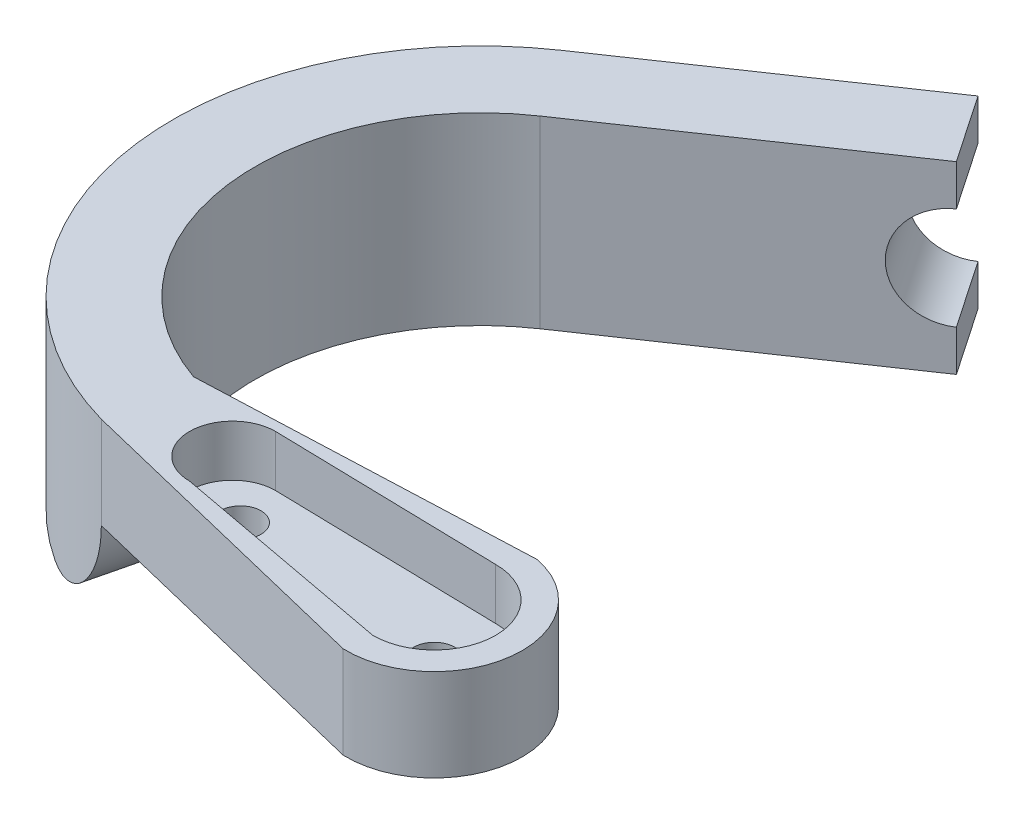
ISO-10303-21;
HEADER;
FILE_DESCRIPTION(('STEP AP214'),'2;1');
FILE_NAME('part.step','',(''),(''),'','','');
FILE_SCHEMA(('AUTOMOTIVE_DESIGN { 1 0 10303 214 1 1 1 1 }'));
ENDSEC;
DATA;
#1=APPLICATION_CONTEXT('core data for automotive mechanical design processes');
#2=APPLICATION_PROTOCOL_DEFINITION('international standard','automotive_design',2000,#1);
#3=PRODUCT_CONTEXT('',#1,'mechanical');
#4=PRODUCT('Part','Part','',(#3));
#5=PRODUCT_RELATED_PRODUCT_CATEGORY('part','',(#4));
#6=PRODUCT_DEFINITION_FORMATION('','',#4);
#7=PRODUCT_DEFINITION_CONTEXT('part definition',#1,'design');
#8=PRODUCT_DEFINITION('design','',#6,#7);
#9=PRODUCT_DEFINITION_SHAPE('','',#8);
#10=(LENGTH_UNIT() NAMED_UNIT(*) SI_UNIT(.MILLI.,.METRE.));
#11=(NAMED_UNIT(*) PLANE_ANGLE_UNIT() SI_UNIT($,.RADIAN.));
#12=(NAMED_UNIT(*) SI_UNIT($,.STERADIAN.) SOLID_ANGLE_UNIT());
#13=UNCERTAINTY_MEASURE_WITH_UNIT(LENGTH_MEASURE(1.E-05),#10,'distance_accuracy_value','');
#14=(GEOMETRIC_REPRESENTATION_CONTEXT(3) GLOBAL_UNCERTAINTY_ASSIGNED_CONTEXT((#13)) GLOBAL_UNIT_ASSIGNED_CONTEXT((#10,
#11,#12)) REPRESENTATION_CONTEXT('',''));
#15=CARTESIAN_POINT('',(0.,0.,0.));
#16=DIRECTION('',(0.,0.,1.));
#17=DIRECTION('',(1.,0.,0.));
#18=AXIS2_PLACEMENT_3D('',#15,#16,#17);
#19=CARTESIAN_POINT('',(0.,0.,0.));
#20=DIRECTION('',(0.,1.,0.));
#21=DIRECTION('',(0.,0.,1.));
#22=AXIS2_PLACEMENT_3D('',#19,#20,#21);
#23=PLANE('',#22);
#24=DIRECTION('',(-0.236788639930873,0.,0.971561186956173));
#25=VECTOR('',#24,1.);
#26=CARTESIAN_POINT('',(-6.07979117203185,0.,3.65452624166835));
#27=LINE('',#26,#25);
#28=CARTESIAN_POINT('',(-8.24336671734017,0.,12.5318356661524));
#29=VERTEX_POINT('',#28);
#30=CARTESIAN_POINT('',(-7.21355707621285,0.,8.30645104649894));
#31=VERTEX_POINT('',#30);
#32=EDGE_CURVE('E12',#29,#31,#27,.F.);
#33=ORIENTED_EDGE('',*,*,#32,.F.);
#34=CARTESIAN_POINT('',(0.,0.,0.));
#35=DIRECTION('',(0.,1.,0.));
#36=DIRECTION('',(0.,0.,1.));
#37=AXIS2_PLACEMENT_3D('',#34,#35,#36);
#38=CIRCLE('',#37,15.);
#39=CARTESIAN_POINT('',(-8.44052173184958,0.,-12.3999029389014));
#40=VERTEX_POINT('',#39);
#41=EDGE_CURVE('E170',#40,#29,#38,.T.);
#42=ORIENTED_EDGE('',*,*,#41,.F.);
#43=DIRECTION('',(0.826660195926758,0.,-0.562701448789972));
#44=VECTOR('',#43,1.);
#45=CARTESIAN_POINT('',(-8.44052173184958,0.,-12.3999029389014));
#46=LINE('',#45,#44);
#47=CARTESIAN_POINT('',(3.66314351152856,0.,-20.6387778740641));
#48=VERTEX_POINT('',#47);
#49=EDGE_CURVE('E236',#40,#48,#46,.T.);
#50=ORIENTED_EDGE('',*,*,#49,.T.);
#51=DIRECTION('',(0.562701448789973,0.,0.826660195926758));
#52=VECTOR('',#51,1.);
#53=CARTESIAN_POINT('',(12.1036652433781,0.,-8.23887493516278));
#54=LINE('',#53,#52);
#55=CARTESIAN_POINT('',(5.91311721210103,0.,-17.3333595138574));
#56=VERTEX_POINT('',#55);
#57=EDGE_CURVE('E234',#48,#56,#54,.T.);
#58=ORIENTED_EDGE('',*,*,#57,.T.);
#59=DIRECTION('',(0.826660195926758,0.,-0.562701448789973));
#60=VECTOR('',#59,1.);
#61=CARTESIAN_POINT('',(-6.19054803127711,0.,-9.09448457869466));
#62=LINE('',#61,#60);
#63=CARTESIAN_POINT('',(-6.19054803127711,0.,-9.09448457869466));
#64=VERTEX_POINT('',#63);
#65=EDGE_CURVE('E230',#64,#56,#62,.T.);
#66=ORIENTED_EDGE('',*,*,#65,.F.);
#67=CARTESIAN_POINT('',(0.,0.,0.));
#68=DIRECTION('',(0.,1.,0.));
#69=DIRECTION('',(0.,0.,1.));
#70=AXIS2_PLACEMENT_3D('',#67,#68,#69);
#71=CIRCLE('',#70,11.0014787496801);
#72=EDGE_CURVE('E227',#64,#31,#71,.T.);
#73=ORIENTED_EDGE('',*,*,#72,.T.);
#74=EDGE_LOOP('',(#33,#42,#50,#58,#66,#73));
#75=FACE_BOUND('',#74,.T.);
#76=ADVANCED_FACE('F38',(#75),#23,.F.);
#77=CARTESIAN_POINT('',(12.1036652433781,9.,-8.23887493516278));
#78=DIRECTION('',(0.826660195926758,0.,-0.562701448789973));
#79=DIRECTION('',(-0.562701448789973,0.,-0.826660195926758));
#80=AXIS2_PLACEMENT_3D('',#77,#78,#79);
#81=PLANE('',#80);
#82=DIRECTION('',(-0.562701448789972,0.,-0.826660195926758));
#83=VECTOR('',#82,1.);
#84=CARTESIAN_POINT('',(6.47665075547842,2.,-16.5054768944304));
#85=LINE('',#84,#83);
#86=CARTESIAN_POINT('',(5.91311721210103,2.,-17.3333595138574));
#87=VERTEX_POINT('',#86);
#88=CARTESIAN_POINT('',(3.66314351152856,2.,-20.6387778740641));
#89=VERTEX_POINT('',#88);
#90=EDGE_CURVE('E60',#87,#89,#85,.T.);
#91=ORIENTED_EDGE('',*,*,#90,.F.);
#92=DIRECTION('',(0.,-1.,0.));
#93=VECTOR('',#92,1.);
#94=CARTESIAN_POINT('',(5.91311721210103,9.,-17.3333595138574));
#95=LINE('',#94,#93);
#96=EDGE_CURVE('E189',#87,#56,#95,.T.);
#97=ORIENTED_EDGE('',*,*,#96,.T.);
#98=ORIENTED_EDGE('',*,*,#57,.F.);
#99=DIRECTION('',(0.,-1.,0.));
#100=VECTOR('',#99,1.);
#101=CARTESIAN_POINT('',(3.66314351152856,9.,-20.6387778740641));
#102=LINE('',#101,#100);
#103=EDGE_CURVE('E179',#89,#48,#102,.T.);
#104=ORIENTED_EDGE('',*,*,#103,.F.);
#105=EDGE_LOOP('',(#91,#97,#98,#104));
#106=FACE_BOUND('',#105,.T.);
#107=ADVANCED_FACE('F323',(#106),#81,.T.);
#108=CARTESIAN_POINT('',(11.696028788895,9.,13.95026889302));
#109=DIRECTION('',(0.,-1.,0.));
#110=DIRECTION('',(0.,0.,-1.));
#111=AXIS2_PLACEMENT_3D('',#108,#109,#110);
#112=CYLINDRICAL_SURFACE('',#111,1.);
#113=CARTESIAN_POINT('',(11.696028788895,4.5,13.95026889302));
#114=DIRECTION('',(0.,1.,0.));
#115=DIRECTION('',(0.,0.,1.));
#116=AXIS2_PLACEMENT_3D('',#113,#114,#115);
#117=CIRCLE('',#116,1.);
#118=CARTESIAN_POINT('',(11.696028788895,4.5,14.9502688930201));
#119=VERTEX_POINT('',#118);
#120=EDGE_CURVE('E214',#119,#119,#117,.T.);
#121=ORIENTED_EDGE('',*,*,#120,.F.);
#122=EDGE_LOOP('',(#121));
#123=FACE_BOUND('',#122,.T.);
#124=CARTESIAN_POINT('',(11.696028788895,6.5,13.95026889302));
#125=DIRECTION('',(0.,1.,0.));
#126=DIRECTION('',(0.,0.,1.));
#127=AXIS2_PLACEMENT_3D('',#124,#125,#126);
#128=CIRCLE('',#127,1.);
#129=CARTESIAN_POINT('',(11.696028788895,6.5,14.9502688930201));
#130=VERTEX_POINT('',#129);
#131=EDGE_CURVE('E265',#130,#130,#128,.F.);
#132=ORIENTED_EDGE('',*,*,#131,.F.);
#133=EDGE_LOOP('',(#132));
#134=FACE_BOUND('',#133,.T.);
#135=ADVANCED_FACE('F330',(#123,#134),#112,.F.);
#136=CARTESIAN_POINT('',(1.19602878889497,9.,12.9105347936986));
#137=DIRECTION('',(0.,-1.,0.));
#138=DIRECTION('',(0.,0.,-1.));
#139=AXIS2_PLACEMENT_3D('',#136,#137,#138);
#140=CYLINDRICAL_SURFACE('',#139,1.);
#141=CARTESIAN_POINT('',(1.19602878889497,4.5,12.9105347936986));
#142=DIRECTION('',(0.,1.,0.));
#143=DIRECTION('',(0.,0.,1.));
#144=AXIS2_PLACEMENT_3D('',#141,#142,#143);
#145=CIRCLE('',#144,1.);
#146=CARTESIAN_POINT('',(1.19602878889497,4.5,13.9105347936986));
#147=VERTEX_POINT('',#146);
#148=EDGE_CURVE('E510',#147,#147,#145,.T.);
#149=ORIENTED_EDGE('',*,*,#148,.F.);
#150=EDGE_LOOP('',(#149));
#151=FACE_BOUND('',#150,.T.);
#152=CARTESIAN_POINT('',(1.19602878889497,6.5,12.9105347936986));
#153=DIRECTION('',(0.,1.,0.));
#154=DIRECTION('',(0.,0.,1.));
#155=AXIS2_PLACEMENT_3D('',#152,#153,#154);
#156=CIRCLE('',#155,1.);
#157=CARTESIAN_POINT('',(1.19602878889497,6.5,13.9105347936986));
#158=VERTEX_POINT('',#157);
#159=EDGE_CURVE('E262',#158,#158,#156,.F.);
#160=ORIENTED_EDGE('',*,*,#159,.F.);
#161=EDGE_LOOP('',(#160));
#162=FACE_BOUND('',#161,.T.);
#163=ADVANCED_FACE('F40',(#151,#162),#140,.F.);
#164=CARTESIAN_POINT('',(-3.54951412236848,9.,14.5639172337523));
#165=DIRECTION('',(-0.236788639930873,0.,0.971561186956173));
#166=DIRECTION('',(0.971561186956173,0.,0.236788639930873));
#167=AXIS2_PLACEMENT_3D('',#164,#165,#166);
#168=PLANE('',#167);
#169=DIRECTION('',(-0.971561186956173,0.,-0.236788639930873));
#170=VECTOR('',#169,1.);
#171=CARTESIAN_POINT('',(-4.07565223003781,4.5,14.435686990919));
#172=LINE('',#171,#170);
#173=CARTESIAN_POINT('',(11.5407363085177,4.5,18.2417091461077));
#174=VERTEX_POINT('',#173);
#175=CARTESIAN_POINT('',(-4.07565223003781,4.5,14.435686990919));
#176=VERTEX_POINT('',#175);
#177=EDGE_CURVE('E153',#174,#176,#172,.T.);
#178=ORIENTED_EDGE('',*,*,#177,.F.);
#179=DIRECTION('',(0.,-1.,0.));
#180=VECTOR('',#179,1.);
#181=CARTESIAN_POINT('',(11.5407363085178,9.,18.2417091461077));
#182=LINE('',#181,#180);
#183=CARTESIAN_POINT('',(11.5407363085178,9.,18.2417091461077));
#184=VERTEX_POINT('',#183);
#185=EDGE_CURVE('E201',#184,#174,#182,.T.);
#186=ORIENTED_EDGE('',*,*,#185,.F.);
#187=DIRECTION('',(-0.971561186956173,0.,-0.236788639930873));
#188=VECTOR('',#187,1.);
#189=CARTESIAN_POINT('',(-3.54951412236848,9.,14.5639172337523));
#190=LINE('',#189,#188);
#191=CARTESIAN_POINT('',(-4.07565223003781,9.,14.435686990919));
#192=VERTEX_POINT('',#191);
#193=EDGE_CURVE('E175',#184,#192,#190,.T.);
#194=ORIENTED_EDGE('',*,*,#193,.T.);
#195=DIRECTION('',(0.,-1.,0.));
#196=VECTOR('',#195,1.);
#197=CARTESIAN_POINT('',(-4.07565223003781,9.,14.435686990919));
#198=LINE('',#197,#196);
#199=EDGE_CURVE('E167',#192,#176,#198,.T.);
#200=ORIENTED_EDGE('',*,*,#199,.T.);
#201=EDGE_LOOP('',(#178,#186,#194,#200));
#202=FACE_BOUND('',#201,.T.);
#203=ADVANCED_FACE('F173',(#202),#168,.T.);
#204=CARTESIAN_POINT('',(11.696028788895,9.,13.95026889302));
#205=DIRECTION('',(0.,-1.,0.));
#206=DIRECTION('',(0.,0.,-1.));
#207=AXIS2_PLACEMENT_3D('',#204,#205,#206);
#208=CYLINDRICAL_SURFACE('',#207,4.29424908456448);
#209=CARTESIAN_POINT('',(11.696028788895,4.5,13.95026889302));
#210=DIRECTION('',(0.,1.,0.));
#211=DIRECTION('',(0.,0.,1.));
#212=AXIS2_PLACEMENT_3D('',#209,#210,#211);
#213=CIRCLE('',#212,4.29424908456448);
#214=CARTESIAN_POINT('',(12.4829765904214,4.5,9.72874211258202));
#215=VERTEX_POINT('',#214);
#216=EDGE_CURVE('E157',#174,#215,#213,.T.);
#217=ORIENTED_EDGE('',*,*,#216,.T.);
#218=DIRECTION('',(0.,-1.,0.));
#219=VECTOR('',#218,1.);
#220=CARTESIAN_POINT('',(12.4829765904214,9.,9.72874211258202));
#221=LINE('',#220,#219);
#222=CARTESIAN_POINT('',(12.4829765904214,9.,9.72874211258202));
#223=VERTEX_POINT('',#222);
#224=EDGE_CURVE('E198',#223,#215,#221,.T.);
#225=ORIENTED_EDGE('',*,*,#224,.F.);
#226=CARTESIAN_POINT('',(11.696028788895,9.,13.95026889302));
#227=DIRECTION('',(0.,1.,0.));
#228=DIRECTION('',(0.,0.,1.));
#229=AXIS2_PLACEMENT_3D('',#226,#227,#228);
#230=CIRCLE('',#229,4.29424908456448);
#231=EDGE_CURVE('E239',#184,#223,#230,.T.);
#232=ORIENTED_EDGE('',*,*,#231,.F.);
#233=ORIENTED_EDGE('',*,*,#185,.T.);
#234=EDGE_LOOP('',(#217,#225,#232,#233));
#235=FACE_BOUND('',#234,.T.);
#236=ADVANCED_FACE('F412',(#235),#208,.T.);
#237=CARTESIAN_POINT('',(0.419716691845322,9.,10.2239659393752));
#238=DIRECTION('',(0.0410176901346047,0.,0.999158420419916));
#239=DIRECTION('',(0.999158420419916,0.,-0.0410176901346047));
#240=AXIS2_PLACEMENT_3D('',#237,#238,#239);
#241=PLANE('',#240);
#242=DIRECTION('',(-0.999158420419916,0.,0.0410176901346047));
#243=VECTOR('',#242,1.);
#244=CARTESIAN_POINT('',(0.419716691845322,4.5,10.2239659393752));
#245=LINE('',#244,#243);
#246=CARTESIAN_POINT('',(-3.08423050628988,4.5,10.3678108167078));
#247=VERTEX_POINT('',#246);
#248=EDGE_CURVE('E515',#215,#247,#245,.T.);
#249=ORIENTED_EDGE('',*,*,#248,.T.);
#250=CARTESIAN_POINT('',(-7.76276096828643,4.5,10.55987496675));
#251=DIRECTION('',(0.0410176901346047,0.,0.999158420419916));
#252=DIRECTION('',(-0.999158420419916,0.,0.0410176901346047));
#253=AXIS2_PLACEMENT_3D('',#250,#251,#252);
#254=ELLIPSE('',#253,4.68247113408733,4.5);
#255=CARTESIAN_POINT('',(-3.61753780258238,2.41349945886795,10.3897042752213));
#256=VERTEX_POINT('',#255);
#257=EDGE_CURVE('E149',#247,#256,#254,.F.);
#258=ORIENTED_EDGE('',*,*,#257,.T.);
#259=DIRECTION('',(0.,-1.,0.));
#260=VECTOR('',#259,1.);
#261=CARTESIAN_POINT('',(-3.61753780258238,9.,10.3897042752213));
#262=LINE('',#261,#260);
#263=CARTESIAN_POINT('',(-3.61753780258238,9.,10.3897042752213));
#264=VERTEX_POINT('',#263);
#265=EDGE_CURVE('E195',#264,#256,#262,.T.);
#266=ORIENTED_EDGE('',*,*,#265,.F.);
#267=DIRECTION('',(-0.999158420419916,0.,0.0410176901346047));
#268=VECTOR('',#267,1.);
#269=CARTESIAN_POINT('',(0.419716691845322,9.,10.2239659393752));
#270=LINE('',#269,#268);
#271=EDGE_CURVE('E242',#223,#264,#270,.T.);
#272=ORIENTED_EDGE('',*,*,#271,.F.);
#273=ORIENTED_EDGE('',*,*,#224,.T.);
#274=EDGE_LOOP('',(#249,#258,#266,#272,#273));
#275=FACE_BOUND('',#274,.T.);
#276=ADVANCED_FACE('F404',(#275),#241,.F.);
#277=CARTESIAN_POINT('',(0.,9.,0.));
#278=DIRECTION('',(0.,-1.,0.));
#279=DIRECTION('',(0.,0.,-1.));
#280=AXIS2_PLACEMENT_3D('',#277,#278,#279);
#281=CYLINDRICAL_SURFACE('',#280,11.0014787496801);
#282=CARTESIAN_POINT('',(-7.21355707621285,0.,8.30645104649894));
#283=CARTESIAN_POINT('',(-7.11637817877443,-1.30252038607061E-05,8.39086871726884));
#284=CARTESIAN_POINT('',(-7.01766950100784,0.00436305968425305,8.47357389263049));
#285=CARTESIAN_POINT('',(-6.8178759643544,0.0222911854630841,8.6351320864922));
#286=CARTESIAN_POINT('',(-6.71678983529978,0.0358482440142726,8.71398297323588));
#287=CARTESIAN_POINT('',(-6.51289832337565,0.072561125377953,8.86741316133901));
#288=CARTESIAN_POINT('',(-6.41009084872094,0.0957295850790254,8.94198669143403));
#289=CARTESIAN_POINT('',(-6.20381296144061,0.151930621458312,9.08631243496018));
#290=CARTESIAN_POINT('',(-6.10034268320312,0.18496125682054,9.1560655939307));
#291=CARTESIAN_POINT('',(-5.89334296160751,0.261170552297762,9.29065887386928));
#292=CARTESIAN_POINT('',(-5.78981469640348,0.304386034238363,9.35548001164004));
#293=CARTESIAN_POINT('',(-5.58418082196105,0.400886499778642,9.47965642716131));
#294=CARTESIAN_POINT('',(-5.48207517964767,0.454171248854104,9.53901183216682));
#295=CARTESIAN_POINT('',(-5.28053230593119,0.570573991663059,9.65203865600819));
#296=CARTESIAN_POINT('',(-5.18109231669549,0.633681323477287,9.70571613307122));
#297=CARTESIAN_POINT('',(-4.98591084535667,0.769435923901944,9.80741240702107));
#298=CARTESIAN_POINT('',(-4.89016903249547,0.842082336785838,9.85543171075586));
#299=CARTESIAN_POINT('',(-4.70877919283217,0.992059878753504,9.94331485809088));
#300=CARTESIAN_POINT('',(-4.62286666965025,1.06889146483179,9.98348681691117));
#301=CARTESIAN_POINT('',(-4.45617782148476,1.23012465252062,10.0589953110382));
#302=CARTESIAN_POINT('',(-4.37540132656027,1.31452600343978,10.0943320063787));
#303=CARTESIAN_POINT('',(-4.21982783954236,1.49027865794152,10.1603507682142));
#304=CARTESIAN_POINT('',(-4.14502787533705,1.58162646240099,10.19103515519));
#305=CARTESIAN_POINT('',(-4.00211239171784,1.77064420415974,10.248002106611));
#306=CARTESIAN_POINT('',(-3.93399402296713,1.8683114168258,10.2742865508012));
#307=CARTESIAN_POINT('',(-3.8236612411627,2.04030580263174,10.3157429752856));
#308=CARTESIAN_POINT('',(-3.7796421161724,2.11324014156875,10.3319335103616));
#309=CARTESIAN_POINT('',(-3.6955891945203,2.2615600032044,10.3622940834815));
#310=CARTESIAN_POINT('',(-3.65554690203304,2.33693982329269,10.3764684580068));
#311=CARTESIAN_POINT('',(-3.61753780258238,2.41349945886795,10.3897042752213));
#312=B_SPLINE_CURVE_WITH_KNOTS('',3,(#282,#283,#284,#285,#286,#287,#288,#289,#290,#291,#292,
#293,#294,#295,#296,#297,#298,#299,#300,#301,#302,#303,#304,#305,#306,#307,#308,#309,#310,#311),
.UNSPECIFIED.,.F.,.F.,(4,2,2,2,2,2,2,2,2,2,2,2,2,2,4),(0.,0.386127170426445,0.772465540706544,
1.15931347936155,1.54608531923724,1.93427752783079,2.32246069611848,2.71022541230918,
3.09795536685463,3.46368995234152,3.82941243009772,4.19495188822901,4.56033477971042,
4.82033378000947,5.07976481682736),.UNSPECIFIED.);
#313=EDGE_CURVE('E171',#31,#256,#312,.T.);
#314=ORIENTED_EDGE('',*,*,#313,.F.);
#315=ORIENTED_EDGE('',*,*,#72,.F.);
#316=DIRECTION('',(0.,-1.,0.));
#317=VECTOR('',#316,1.);
#318=CARTESIAN_POINT('',(-6.19054803127711,9.,-9.09448457869466));
#319=LINE('',#318,#317);
#320=CARTESIAN_POINT('',(-6.19054803127711,9.,-9.09448457869466));
#321=VERTEX_POINT('',#320);
#322=EDGE_CURVE('E193',#321,#64,#319,.T.);
#323=ORIENTED_EDGE('',*,*,#322,.F.);
#324=CARTESIAN_POINT('',(0.,9.,0.));
#325=DIRECTION('',(0.,1.,0.));
#326=DIRECTION('',(0.,0.,1.));
#327=AXIS2_PLACEMENT_3D('',#324,#325,#326);
#328=CIRCLE('',#327,11.0014787496801);
#329=EDGE_CURVE('E249',#321,#264,#328,.T.);
#330=ORIENTED_EDGE('',*,*,#329,.T.);
#331=ORIENTED_EDGE('',*,*,#265,.T.);
#332=EDGE_LOOP('',(#314,#315,#323,#330,#331));
#333=FACE_BOUND('',#332,.T.);
#334=ADVANCED_FACE('F400',(#333),#281,.F.);
#335=CARTESIAN_POINT('',(-6.19054803127711,9.,-9.09448457869466));
#336=DIRECTION('',(-0.562701448789973,0.,-0.826660195926758));
#337=DIRECTION('',(-0.826660195926758,0.,0.562701448789973));
#338=AXIS2_PLACEMENT_3D('',#335,#336,#337);
#339=PLANE('',#338);
#340=ORIENTED_EDGE('',*,*,#96,.F.);
#341=CARTESIAN_POINT('',(5.91311721210103,4.5,-17.3333595138574));
#342=DIRECTION('',(-0.562701448789973,0.,-0.826660195926758));
#343=DIRECTION('',(-0.826660195926758,0.,0.562701448789973));
#344=AXIS2_PLACEMENT_3D('',#341,#342,#343);
#345=CIRCLE('',#344,2.5);
#346=CARTESIAN_POINT('',(5.91311721210103,7.,-17.3333595138574));
#347=VERTEX_POINT('',#346);
#348=EDGE_CURVE('E213',#87,#347,#345,.T.);
#349=ORIENTED_EDGE('',*,*,#348,.T.);
#350=CARTESIAN_POINT('',(5.91311721210103,9.,-17.3333595138574));
#351=VERTEX_POINT('',#350);
#352=EDGE_CURVE('E190',#351,#347,#95,.T.);
#353=ORIENTED_EDGE('',*,*,#352,.F.);
#354=DIRECTION('',(0.826660195926758,0.,-0.562701448789973));
#355=VECTOR('',#354,1.);
#356=CARTESIAN_POINT('',(-6.19054803127711,9.,-9.09448457869466));
#357=LINE('',#356,#355);
#358=EDGE_CURVE('E223',#321,#351,#357,.T.);
#359=ORIENTED_EDGE('',*,*,#358,.F.);
#360=ORIENTED_EDGE('',*,*,#322,.T.);
#361=ORIENTED_EDGE('',*,*,#65,.T.);
#362=EDGE_LOOP('',(#340,#349,#353,#359,#360,#361));
#363=FACE_BOUND('',#362,.T.);
#364=ADVANCED_FACE('F256',(#363),#339,.F.);
#365=DIRECTION('',(-0.562701448789972,0.,-0.826660195926758));
#366=VECTOR('',#365,1.);
#367=CARTESIAN_POINT('',(6.47665075547842,7.,-16.5054768944304));
#368=LINE('',#367,#366);
#369=CARTESIAN_POINT('',(3.66314351152856,7.,-20.6387778740641));
#370=VERTEX_POINT('',#369);
#371=EDGE_CURVE('E204',#370,#347,#368,.F.);
#372=ORIENTED_EDGE('',*,*,#371,.F.);
#373=CARTESIAN_POINT('',(3.66314351152856,9.,-20.6387778740641));
#374=VERTEX_POINT('',#373);
#375=EDGE_CURVE('E186',#374,#370,#102,.T.);
#376=ORIENTED_EDGE('',*,*,#375,.F.);
#377=DIRECTION('',(0.562701448789973,0.,0.826660195926758));
#378=VECTOR('',#377,1.);
#379=CARTESIAN_POINT('',(12.1036652433781,9.,-8.23887493516278));
#380=LINE('',#379,#378);
#381=EDGE_CURVE('E221',#374,#351,#380,.T.);
#382=ORIENTED_EDGE('',*,*,#381,.T.);
#383=ORIENTED_EDGE('',*,*,#352,.T.);
#384=EDGE_LOOP('',(#372,#376,#382,#383));
#385=FACE_BOUND('',#384,.T.);
#386=ADVANCED_FACE('F209',(#385),#81,.T.);
#387=CARTESIAN_POINT('',(-8.44052173184958,9.,-12.3999029389014));
#388=DIRECTION('',(-0.562701448789972,0.,-0.826660195926758));
#389=DIRECTION('',(-0.826660195926758,0.,0.562701448789972));
#390=AXIS2_PLACEMENT_3D('',#387,#388,#389);
#391=PLANE('',#390);
#392=CARTESIAN_POINT('',(3.66314351152856,4.5,-20.6387778740641));
#393=DIRECTION('',(-0.562701448789972,0.,-0.826660195926758));
#394=DIRECTION('',(-0.826660195926758,0.,0.562701448789972));
#395=AXIS2_PLACEMENT_3D('',#392,#393,#394);
#396=CIRCLE('',#395,2.5);
#397=EDGE_CURVE('E46',#89,#370,#396,.T.);
#398=ORIENTED_EDGE('',*,*,#397,.F.);
#399=ORIENTED_EDGE('',*,*,#103,.T.);
#400=ORIENTED_EDGE('',*,*,#49,.F.);
#401=DIRECTION('',(0.,-1.,0.));
#402=VECTOR('',#401,1.);
#403=CARTESIAN_POINT('',(-8.44052173184958,9.,-12.3999029389014));
#404=LINE('',#403,#402);
#405=CARTESIAN_POINT('',(-8.44052173184958,9.,-12.3999029389014));
#406=VERTEX_POINT('',#405);
#407=EDGE_CURVE('E176',#406,#40,#404,.T.);
#408=ORIENTED_EDGE('',*,*,#407,.F.);
#409=DIRECTION('',(0.826660195926758,0.,-0.562701448789972));
#410=VECTOR('',#409,1.);
#411=CARTESIAN_POINT('',(-8.44052173184958,9.,-12.3999029389014));
#412=LINE('',#411,#410);
#413=EDGE_CURVE('E181',#406,#374,#412,.T.);
#414=ORIENTED_EDGE('',*,*,#413,.T.);
#415=ORIENTED_EDGE('',*,*,#375,.T.);
#416=EDGE_LOOP('',(#398,#399,#400,#408,#414,#415));
#417=FACE_BOUND('',#416,.T.);
#418=ADVANCED_FACE('F217',(#417),#391,.T.);
#419=CARTESIAN_POINT('',(0.,9.,0.));
#420=DIRECTION('',(0.,-1.,0.));
#421=DIRECTION('',(0.,0.,-1.));
#422=AXIS2_PLACEMENT_3D('',#419,#420,#421);
#423=CYLINDRICAL_SURFACE('',#422,15.);
#424=ORIENTED_EDGE('',*,*,#41,.T.);
#425=CARTESIAN_POINT('',(-8.24336671734017,0.,12.5318356661524));
#426=CARTESIAN_POINT('',(-8.13669918510861,-1.3839911670359E-05,12.6020187315005));
#427=CARTESIAN_POINT('',(-8.02910413587202,0.0048201584501696,12.6708254407666));
#428=CARTESIAN_POINT('',(-7.81281923182778,0.0243592312252365,12.8053097438333));
#429=CARTESIAN_POINT('',(-7.70412906596383,0.0390671928119944,12.8709864163852));
#430=CARTESIAN_POINT('',(-7.4864339115032,0.0785377038107717,12.9988183075535));
#431=CARTESIAN_POINT('',(-7.37742881426547,0.103304277217587,13.060972105474));
#432=CARTESIAN_POINT('',(-7.16005105693986,0.162944074195945,13.1813920981722));
#433=CARTESIAN_POINT('',(-7.0516783242126,0.197816112677549,13.2396587478192));
#434=CARTESIAN_POINT('',(-6.83626615969735,0.277702492576699,13.3521632674072));
#435=CARTESIAN_POINT('',(-6.72923001079619,0.322738007158818,13.4063924079348));
#436=CARTESIAN_POINT('',(-6.51766520767112,0.42275817110471,13.5105124489429));
#437=CARTESIAN_POINT('',(-6.41313750977438,0.477746548757223,13.560401713325));
#438=CARTESIAN_POINT('',(-6.20774440159629,0.5972983695976,13.6556475920303));
#439=CARTESIAN_POINT('',(-6.10687474390304,0.661850234455826,13.7010095778153));
#440=CARTESIAN_POINT('',(-5.90959740124116,0.80020047158135,13.7872496829918));
#441=CARTESIAN_POINT('',(-5.81319135883433,0.874002211244969,13.8281261592274));
#442=CARTESIAN_POINT('',(-5.62881353722998,1.02782084839198,13.9041751197848));
#443=CARTESIAN_POINT('',(-5.54067057820715,1.10756327243196,13.9394882786867));
#444=CARTESIAN_POINT('',(-5.37023713244863,1.27470811233786,14.0060318083203));
#445=CARTESIAN_POINT('',(-5.28794877968503,1.36211329558796,14.0372606937978));
#446=CARTESIAN_POINT('',(-5.12999461873246,1.54395092311489,14.0957529264027));
#447=CARTESIAN_POINT('',(-5.05432884559265,1.63838340457792,14.1230162525433));
#448=CARTESIAN_POINT('',(-4.91025992743661,1.83364839004457,14.1737498274938));
#449=CARTESIAN_POINT('',(-4.8418594506076,1.9344832237456,14.1972186844221));
#450=CARTESIAN_POINT('',(-4.71281620315227,2.14202545109092,14.2405761172125));
#451=CARTESIAN_POINT('',(-4.65218949734865,2.2487443741641,14.2604573124697));
#452=CARTESIAN_POINT('',(-4.53935764666618,2.46715891380693,14.2967740152023));
#453=CARTESIAN_POINT('',(-4.48715585103673,2.57885648718681,14.3132081531044));
#454=CARTESIAN_POINT('',(-4.39168253834829,2.80633560907571,14.342789977315));
#455=CARTESIAN_POINT('',(-4.34840463384041,2.92211416654779,14.3559400157154));
#456=CARTESIAN_POINT('',(-4.27109199464637,3.15702524173206,14.3791305056873));
#457=CARTESIAN_POINT('',(-4.23705941625573,3.27615853473386,14.3891702319144));
#458=CARTESIAN_POINT('',(-4.16401288747836,3.57678819295283,14.4105216021764));
#459=CARTESIAN_POINT('',(-4.1309012495655,3.75990694850441,14.4199940289415));
#460=CARTESIAN_POINT('',(-4.09776929634757,4.03647912240153,14.4294281217654));
#461=CARTESIAN_POINT('',(-4.0894812398528,4.12895394164004,14.4317770733507));
#462=CARTESIAN_POINT('',(-4.07842269992114,4.31427571401899,14.4349051957854));
#463=CARTESIAN_POINT('',(-4.07565318450893,4.40712272958594,14.4356840912265));
#464=CARTESIAN_POINT('',(-4.0756522300378,4.50000000000009,14.435686990919));
#465=B_SPLINE_CURVE_WITH_KNOTS('',3,(#425,#426,#427,#428,#429,#430,#431,#432,#433,#434,#435,
#436,#437,#438,#439,#440,#441,#442,#443,#444,#445,#446,#447,#448,#449,#450,#451,#452,#453,#454,
#455,#456,#457,#458,#459,#460,#461,#462,#463,#464),.UNSPECIFIED.,.F.,.F.,(4,2,2,2,2,2,2,2,2,2,2,
2,2,2,2,2,2,2,2,4),(0.,0.382981953892536,0.766075941547168,1.14932333894781,1.53252581026561,
1.91653408457129,2.30068650513341,2.68437758394068,3.06820875257766,3.43975678302436,
3.81143955416514,4.18312429227126,4.55494506340774,4.92752224129442,5.30024717107294,
5.6727043824862,6.04524838798653,6.60258087612602,6.88105891663997,7.15958580156634),.UNSPECIFIED.);
#466=EDGE_CURVE('E52',#29,#176,#465,.T.);
#467=ORIENTED_EDGE('',*,*,#466,.T.);
#468=ORIENTED_EDGE('',*,*,#199,.F.);
#469=CARTESIAN_POINT('',(0.,9.,0.));
#470=DIRECTION('',(0.,1.,0.));
#471=DIRECTION('',(0.,0.,1.));
#472=AXIS2_PLACEMENT_3D('',#469,#470,#471);
#473=CIRCLE('',#472,15.);
#474=EDGE_CURVE('E177',#406,#192,#473,.T.);
#475=ORIENTED_EDGE('',*,*,#474,.F.);
#476=ORIENTED_EDGE('',*,*,#407,.T.);
#477=EDGE_LOOP('',(#424,#467,#468,#475,#476));
#478=FACE_BOUND('',#477,.T.);
#479=ADVANCED_FACE('F165',(#478),#423,.T.);
#480=CARTESIAN_POINT('',(0.,9.,0.));
#481=DIRECTION('',(0.,1.,0.));
#482=DIRECTION('',(0.,0.,1.));
#483=AXIS2_PLACEMENT_3D('',#480,#481,#482);
#484=PLANE('',#483);
#485=DIRECTION('',(-0.999740656596785,0.,-0.0227732199618358));
#486=VECTOR('',#485,1.);
#487=CARTESIAN_POINT('',(-0.243242419772845,9.,10.6783027109659));
#488=LINE('',#487,#486);
#489=CARTESIAN_POINT('',(11.696028788895,9.,10.9502688930202));
#490=VERTEX_POINT('',#489);
#491=CARTESIAN_POINT('',(0.696028788894971,9.,10.6996984896588));
#492=VERTEX_POINT('',#491);
#493=EDGE_CURVE('E258',#490,#492,#488,.T.);
#494=ORIENTED_EDGE('',*,*,#493,.F.);
#495=CARTESIAN_POINT('',(11.696028788895,9.,13.95026889302));
#496=DIRECTION('',(0.,1.,0.));
#497=DIRECTION('',(0.,0.,1.));
#498=AXIS2_PLACEMENT_3D('',#495,#496,#497);
#499=CIRCLE('',#498,2.99999999999988);
#500=CARTESIAN_POINT('',(11.696028788895,9.,16.9502688930199));
#501=VERTEX_POINT('',#500);
#502=EDGE_CURVE('E266',#501,#490,#499,.T.);
#503=ORIENTED_EDGE('',*,*,#502,.F.);
#504=DIRECTION('',(-0.983080064931331,0.,-0.183176379303146));
#505=VECTOR('',#504,1.);
#506=CARTESIAN_POINT('',(-2.65991065866292,9.,14.2753402648186));
#507=LINE('',#506,#505);
#508=CARTESIAN_POINT('',(0.696028788894971,9.,14.9006492900882));
#509=VERTEX_POINT('',#508);
#510=EDGE_CURVE('E284',#501,#509,#507,.T.);
#511=ORIENTED_EDGE('',*,*,#510,.T.);
#512=CARTESIAN_POINT('',(0.696028788894971,9.,12.8001738898735));
#513=DIRECTION('',(0.,1.,0.));
#514=DIRECTION('',(0.,0.,1.));
#515=AXIS2_PLACEMENT_3D('',#512,#513,#514);
#516=CIRCLE('',#515,2.10047540021471);
#517=EDGE_CURVE('E281',#492,#509,#516,.T.);
#518=ORIENTED_EDGE('',*,*,#517,.F.);
#519=EDGE_LOOP('',(#494,#503,#511,#518));
#520=FACE_BOUND('',#519,.T.);
#521=ORIENTED_EDGE('',*,*,#193,.F.);
#522=ORIENTED_EDGE('',*,*,#231,.T.);
#523=ORIENTED_EDGE('',*,*,#271,.T.);
#524=ORIENTED_EDGE('',*,*,#329,.F.);
#525=ORIENTED_EDGE('',*,*,#358,.T.);
#526=ORIENTED_EDGE('',*,*,#381,.F.);
#527=ORIENTED_EDGE('',*,*,#413,.F.);
#528=ORIENTED_EDGE('',*,*,#474,.T.);
#529=EDGE_LOOP('',(#521,#522,#523,#524,#525,#526,#527,#528));
#530=FACE_BOUND('',#529,.T.);
#531=ADVANCED_FACE('F253',(#520,#530),#484,.T.);
#532=CARTESIAN_POINT('',(-0.243242419772845,6.5,10.6783027109659));
#533=DIRECTION('',(0.0227732199618358,0.,-0.999740656596785));
#534=DIRECTION('',(-0.999740656596785,0.,-0.0227732199618358));
#535=AXIS2_PLACEMENT_3D('',#532,#533,#534);
#536=PLANE('',#535);
#537=ORIENTED_EDGE('',*,*,#493,.T.);
#538=DIRECTION('',(0.,1.,0.));
#539=VECTOR('',#538,1.);
#540=CARTESIAN_POINT('',(0.696028788894971,6.5,10.6996984896588));
#541=LINE('',#540,#539);
#542=CARTESIAN_POINT('',(0.696028788894971,6.5,10.6996984896588));
#543=VERTEX_POINT('',#542);
#544=EDGE_CURVE('E245',#543,#492,#541,.T.);
#545=ORIENTED_EDGE('',*,*,#544,.F.);
#546=DIRECTION('',(-0.999740656596785,0.,-0.0227732199618358));
#547=VECTOR('',#546,1.);
#548=CARTESIAN_POINT('',(-0.243242419772845,6.5,10.6783027109659));
#549=LINE('',#548,#547);
#550=CARTESIAN_POINT('',(11.696028788895,6.5,10.9502688930202));
#551=VERTEX_POINT('',#550);
#552=EDGE_CURVE('E269',#551,#543,#549,.T.);
#553=ORIENTED_EDGE('',*,*,#552,.F.);
#554=DIRECTION('',(0.,1.,0.));
#555=VECTOR('',#554,1.);
#556=CARTESIAN_POINT('',(11.696028788895,6.5,10.9502688930202));
#557=LINE('',#556,#555);
#558=EDGE_CURVE('E231',#551,#490,#557,.T.);
#559=ORIENTED_EDGE('',*,*,#558,.T.);
#560=EDGE_LOOP('',(#537,#545,#553,#559));
#561=FACE_BOUND('',#560,.T.);
#562=ADVANCED_FACE('F312',(#561),#536,.F.);
#563=CARTESIAN_POINT('',(11.696028788895,6.5,13.95026889302));
#564=DIRECTION('',(0.,1.,0.));
#565=DIRECTION('',(0.,0.,1.));
#566=AXIS2_PLACEMENT_3D('',#563,#564,#565);
#567=CYLINDRICAL_SURFACE('',#566,2.99999999999988);
#568=ORIENTED_EDGE('',*,*,#502,.T.);
#569=ORIENTED_EDGE('',*,*,#558,.F.);
#570=CARTESIAN_POINT('',(11.696028788895,6.5,13.95026889302));
#571=DIRECTION('',(0.,1.,0.));
#572=DIRECTION('',(0.,0.,1.));
#573=AXIS2_PLACEMENT_3D('',#570,#571,#572);
#574=CIRCLE('',#573,2.99999999999988);
#575=CARTESIAN_POINT('',(11.696028788895,6.5,16.9502688930199));
#576=VERTEX_POINT('',#575);
#577=EDGE_CURVE('E277',#576,#551,#574,.T.);
#578=ORIENTED_EDGE('',*,*,#577,.F.);
#579=DIRECTION('',(0.,1.,0.));
#580=VECTOR('',#579,1.);
#581=CARTESIAN_POINT('',(11.696028788895,6.5,16.9502688930199));
#582=LINE('',#581,#580);
#583=EDGE_CURVE('E290',#576,#501,#582,.T.);
#584=ORIENTED_EDGE('',*,*,#583,.T.);
#585=EDGE_LOOP('',(#568,#569,#578,#584));
#586=FACE_BOUND('',#585,.T.);
#587=ADVANCED_FACE('F311',(#586),#567,.F.);
#588=CARTESIAN_POINT('',(-2.65991065866292,6.5,14.2753402648186));
#589=DIRECTION('',(0.183176379303146,0.,-0.983080064931331));
#590=DIRECTION('',(-0.983080064931331,0.,-0.183176379303146));
#591=AXIS2_PLACEMENT_3D('',#588,#589,#590);
#592=PLANE('',#591);
#593=ORIENTED_EDGE('',*,*,#510,.F.);
#594=ORIENTED_EDGE('',*,*,#583,.F.);
#595=DIRECTION('',(-0.983080064931331,0.,-0.183176379303146));
#596=VECTOR('',#595,1.);
#597=CARTESIAN_POINT('',(-2.65991065866292,6.5,14.2753402648186));
#598=LINE('',#597,#596);
#599=CARTESIAN_POINT('',(0.696028788894971,6.5,14.9006492900882));
#600=VERTEX_POINT('',#599);
#601=EDGE_CURVE('E275',#576,#600,#598,.T.);
#602=ORIENTED_EDGE('',*,*,#601,.T.);
#603=DIRECTION('',(0.,1.,0.));
#604=VECTOR('',#603,1.);
#605=CARTESIAN_POINT('',(0.696028788894971,6.5,14.9006492900882));
#606=LINE('',#605,#604);
#607=EDGE_CURVE('E291',#600,#509,#606,.T.);
#608=ORIENTED_EDGE('',*,*,#607,.T.);
#609=EDGE_LOOP('',(#593,#594,#602,#608));
#610=FACE_BOUND('',#609,.T.);
#611=ADVANCED_FACE('F305',(#610),#592,.T.);
#612=CARTESIAN_POINT('',(0.696028788894971,6.5,12.8001738898735));
#613=DIRECTION('',(0.,1.,0.));
#614=DIRECTION('',(0.,0.,1.));
#615=AXIS2_PLACEMENT_3D('',#612,#613,#614);
#616=CYLINDRICAL_SURFACE('',#615,2.10047540021471);
#617=ORIENTED_EDGE('',*,*,#517,.T.);
#618=ORIENTED_EDGE('',*,*,#607,.F.);
#619=CARTESIAN_POINT('',(0.696028788894971,6.5,12.8001738898735));
#620=DIRECTION('',(0.,1.,0.));
#621=DIRECTION('',(0.,0.,1.));
#622=AXIS2_PLACEMENT_3D('',#619,#620,#621);
#623=CIRCLE('',#622,2.10047540021471);
#624=EDGE_CURVE('E272',#543,#600,#623,.T.);
#625=ORIENTED_EDGE('',*,*,#624,.F.);
#626=ORIENTED_EDGE('',*,*,#544,.T.);
#627=EDGE_LOOP('',(#617,#618,#625,#626));
#628=FACE_BOUND('',#627,.T.);
#629=ADVANCED_FACE('F299',(#628),#616,.F.);
#630=CARTESIAN_POINT('',(0.,6.5,0.));
#631=DIRECTION('',(0.,1.,0.));
#632=DIRECTION('',(0.,0.,1.));
#633=AXIS2_PLACEMENT_3D('',#630,#631,#632);
#634=PLANE('',#633);
#635=ORIENTED_EDGE('',*,*,#159,.T.);
#636=EDGE_LOOP('',(#635));
#637=FACE_BOUND('',#636,.T.);
#638=ORIENTED_EDGE('',*,*,#131,.T.);
#639=EDGE_LOOP('',(#638));
#640=FACE_BOUND('',#639,.T.);
#641=ORIENTED_EDGE('',*,*,#552,.T.);
#642=ORIENTED_EDGE('',*,*,#624,.T.);
#643=ORIENTED_EDGE('',*,*,#601,.F.);
#644=ORIENTED_EDGE('',*,*,#577,.T.);
#645=EDGE_LOOP('',(#641,#642,#643,#644));
#646=FACE_BOUND('',#645,.T.);
#647=ADVANCED_FACE('F310',(#637,#640,#646),#634,.T.);
#648=CARTESIAN_POINT('',(6.47665075547842,4.5,-16.5054768944304));
#649=DIRECTION('',(-0.562701448789972,0.,-0.826660195926758));
#650=DIRECTION('',(-0.826660195926758,0.,0.562701448789972));
#651=AXIS2_PLACEMENT_3D('',#648,#649,#650);
#652=CYLINDRICAL_SURFACE('',#651,2.5);
#653=ORIENTED_EDGE('',*,*,#90,.T.);
#654=ORIENTED_EDGE('',*,*,#397,.T.);
#655=ORIENTED_EDGE('',*,*,#371,.T.);
#656=ORIENTED_EDGE('',*,*,#348,.F.);
#657=EDGE_LOOP('',(#653,#654,#655,#656));
#658=FACE_BOUND('',#657,.T.);
#659=ADVANCED_FACE('F203',(#658),#652,.F.);
#660=CARTESIAN_POINT('',(-1.70776583072908,4.5,4.72007512135728));
#661=DIRECTION('',(0.,1.,0.));
#662=DIRECTION('',(0.,0.,1.));
#663=AXIS2_PLACEMENT_3D('',#660,#661,#662);
#664=PLANE('',#663);
#665=ORIENTED_EDGE('',*,*,#120,.T.);
#666=EDGE_LOOP('',(#665));
#667=FACE_BOUND('',#666,.T.);
#668=ORIENTED_EDGE('',*,*,#148,.T.);
#669=EDGE_LOOP('',(#668));
#670=FACE_BOUND('',#669,.T.);
#671=ORIENTED_EDGE('',*,*,#177,.T.);
#672=DIRECTION('',(-0.236788639930873,0.,0.971561186956173));
#673=VECTOR('',#672,1.);
#674=CARTESIAN_POINT('',(-1.70776583072908,4.5,4.72007512135728));
#675=LINE('',#674,#673);
#676=EDGE_CURVE('E145',#247,#176,#675,.T.);
#677=ORIENTED_EDGE('',*,*,#676,.F.);
#678=ORIENTED_EDGE('',*,*,#248,.F.);
#679=ORIENTED_EDGE('',*,*,#216,.F.);
#680=EDGE_LOOP('',(#671,#677,#678,#679));
#681=FACE_BOUND('',#680,.T.);
#682=ADVANCED_FACE('F156',(#667,#670,#681),#664,.F.);
#683=CARTESIAN_POINT('',(-6.07979117203185,4.5,3.65452624166835));
#684=DIRECTION('',(-0.236788639930873,0.,0.971561186956173));
#685=DIRECTION('',(0.971561186956173,0.,0.236788639930873));
#686=AXIS2_PLACEMENT_3D('',#683,#684,#685);
#687=CYLINDRICAL_SURFACE('',#686,4.5);
#688=ORIENTED_EDGE('',*,*,#676,.T.);
#689=ORIENTED_EDGE('',*,*,#466,.F.);
#690=ORIENTED_EDGE('',*,*,#32,.T.);
#691=ORIENTED_EDGE('',*,*,#313,.T.);
#692=ORIENTED_EDGE('',*,*,#257,.F.);
#693=EDGE_LOOP('',(#688,#689,#690,#691,#692));
#694=FACE_BOUND('',#693,.T.);
#695=ADVANCED_FACE('F147',(#694),#687,.T.);
#696=CLOSED_SHELL('',(#76,#107,#135,#163,#203,#236,#276,#334,#364,#386,#418,#479,#531,#562,#587,
#611,#629,#647,#659,#682,#695));
#697=MANIFOLD_SOLID_BREP('B2',#696);
#698=ADVANCED_BREP_SHAPE_REPRESENTATION('',(#18,#697),#14);
#699=SHAPE_DEFINITION_REPRESENTATION(#9,#698);
ENDSEC;
END-ISO-10303-21;
